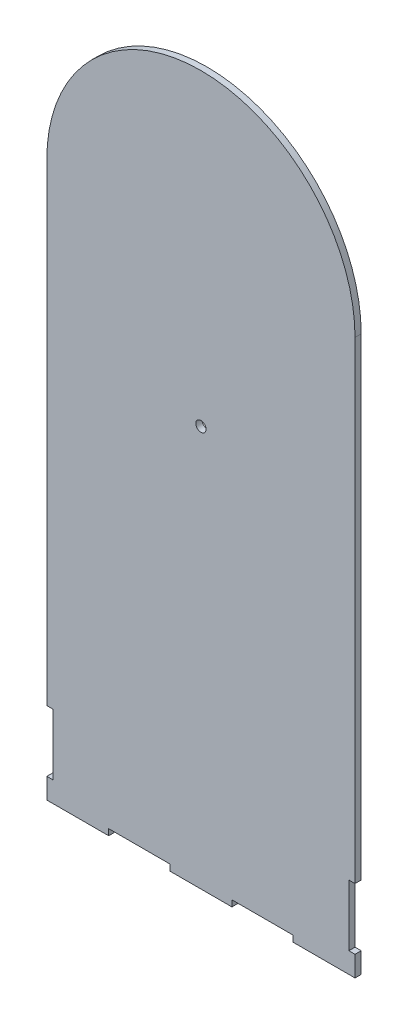
ISO-10303-21;
HEADER;
FILE_DESCRIPTION(('STEP AP214'),'2;1');
FILE_NAME('part.step','',(''),(''),'','','');
FILE_SCHEMA(('AUTOMOTIVE_DESIGN { 1 0 10303 214 1 1 1 1 }'));
ENDSEC;
DATA;
#1=APPLICATION_CONTEXT('core data for automotive mechanical design processes');
#2=APPLICATION_PROTOCOL_DEFINITION('international standard','automotive_design',2000,#1);
#3=PRODUCT_CONTEXT('',#1,'mechanical');
#4=PRODUCT('Part','Part','',(#3));
#5=PRODUCT_RELATED_PRODUCT_CATEGORY('part','',(#4));
#6=PRODUCT_DEFINITION_FORMATION('','',#4);
#7=PRODUCT_DEFINITION_CONTEXT('part definition',#1,'design');
#8=PRODUCT_DEFINITION('design','',#6,#7);
#9=PRODUCT_DEFINITION_SHAPE('','',#8);
#10=(LENGTH_UNIT() NAMED_UNIT(*) SI_UNIT(.MILLI.,.METRE.));
#11=(NAMED_UNIT(*) PLANE_ANGLE_UNIT() SI_UNIT($,.RADIAN.));
#12=(NAMED_UNIT(*) SI_UNIT($,.STERADIAN.) SOLID_ANGLE_UNIT());
#13=UNCERTAINTY_MEASURE_WITH_UNIT(LENGTH_MEASURE(1.E-05),#10,'distance_accuracy_value','');
#14=(GEOMETRIC_REPRESENTATION_CONTEXT(3) GLOBAL_UNCERTAINTY_ASSIGNED_CONTEXT((#13)) GLOBAL_UNIT_ASSIGNED_CONTEXT((#10,
#11,#12)) REPRESENTATION_CONTEXT('',''));
#15=CARTESIAN_POINT('',(0.,0.,0.));
#16=DIRECTION('',(0.,0.,1.));
#17=DIRECTION('',(1.,0.,0.));
#18=AXIS2_PLACEMENT_3D('',#15,#16,#17);
#19=CARTESIAN_POINT('',(150.,0.,3.));
#20=DIRECTION('',(-1.,0.,0.));
#21=DIRECTION('',(0.,-1.,0.));
#22=AXIS2_PLACEMENT_3D('',#19,#20,#21);
#23=PLANE('',#22);
#24=DIRECTION('',(0.,1.,0.));
#25=VECTOR('',#24,1.);
#26=CARTESIAN_POINT('',(150.,0.,0.));
#27=LINE('',#26,#25);
#28=CARTESIAN_POINT('',(150.,39.8,0.));
#29=VERTEX_POINT('',#28);
#30=CARTESIAN_POINT('',(150.,270.,0.));
#31=VERTEX_POINT('',#30);
#32=EDGE_CURVE('E221',#29,#31,#27,.T.);
#33=ORIENTED_EDGE('',*,*,#32,.T.);
#34=DIRECTION('',(0.,0.,-1.));
#35=VECTOR('',#34,1.);
#36=CARTESIAN_POINT('',(150.,270.,3.));
#37=LINE('',#36,#35);
#38=CARTESIAN_POINT('',(150.,270.,3.));
#39=VERTEX_POINT('',#38);
#40=EDGE_CURVE('E11',#39,#31,#37,.T.);
#41=ORIENTED_EDGE('',*,*,#40,.F.);
#42=DIRECTION('',(0.,1.,0.));
#43=VECTOR('',#42,1.);
#44=CARTESIAN_POINT('',(150.,0.,3.));
#45=LINE('',#44,#43);
#46=CARTESIAN_POINT('',(150.,39.8,3.));
#47=VERTEX_POINT('',#46);
#48=EDGE_CURVE('E287',#47,#39,#45,.T.);
#49=ORIENTED_EDGE('',*,*,#48,.F.);
#50=DIRECTION('',(0.,0.,-1.));
#51=VECTOR('',#50,1.);
#52=CARTESIAN_POINT('',(150.,39.8,3.));
#53=LINE('',#52,#51);
#54=EDGE_CURVE('E59',#47,#29,#53,.T.);
#55=ORIENTED_EDGE('',*,*,#54,.T.);
#56=EDGE_LOOP('',(#33,#41,#49,#55));
#57=FACE_BOUND('',#56,.T.);
#58=ADVANCED_FACE('F41',(#57),#23,.F.);
#59=CARTESIAN_POINT('',(75.,270.,3.));
#60=DIRECTION('',(0.,0.,-1.));
#61=DIRECTION('',(-1.,0.,0.));
#62=AXIS2_PLACEMENT_3D('',#59,#60,#61);
#63=CYLINDRICAL_SURFACE('',#62,75.);
#64=CARTESIAN_POINT('',(75.,270.,0.));
#65=DIRECTION('',(0.,0.,1.));
#66=DIRECTION('',(1.,0.,0.));
#67=AXIS2_PLACEMENT_3D('',#64,#65,#66);
#68=CIRCLE('',#67,75.);
#69=CARTESIAN_POINT('',(0.,270.,0.));
#70=VERTEX_POINT('',#69);
#71=EDGE_CURVE('E224',#31,#70,#68,.T.);
#72=ORIENTED_EDGE('',*,*,#71,.T.);
#73=DIRECTION('',(0.,0.,-1.));
#74=VECTOR('',#73,1.);
#75=CARTESIAN_POINT('',(0.,270.,3.));
#76=LINE('',#75,#74);
#77=CARTESIAN_POINT('',(0.,270.,3.));
#78=VERTEX_POINT('',#77);
#79=EDGE_CURVE('E51',#78,#70,#76,.T.);
#80=ORIENTED_EDGE('',*,*,#79,.F.);
#81=CARTESIAN_POINT('',(75.,270.,3.));
#82=DIRECTION('',(0.,0.,1.));
#83=DIRECTION('',(1.,0.,0.));
#84=AXIS2_PLACEMENT_3D('',#81,#82,#83);
#85=CIRCLE('',#84,75.);
#86=EDGE_CURVE('E133',#39,#78,#85,.T.);
#87=ORIENTED_EDGE('',*,*,#86,.F.);
#88=ORIENTED_EDGE('',*,*,#40,.T.);
#89=EDGE_LOOP('',(#72,#80,#87,#88));
#90=FACE_BOUND('',#89,.T.);
#91=ADVANCED_FACE('F43',(#90),#63,.T.);
#92=CARTESIAN_POINT('',(0.,0.,3.));
#93=DIRECTION('',(-1.,0.,0.));
#94=DIRECTION('',(0.,0.,1.));
#95=AXIS2_PLACEMENT_3D('',#92,#93,#94);
#96=PLANE('',#95);
#97=DIRECTION('',(0.,1.,0.));
#98=VECTOR('',#97,1.);
#99=CARTESIAN_POINT('',(0.,0.,0.));
#100=LINE('',#99,#98);
#101=CARTESIAN_POINT('',(0.,39.8,0.));
#102=VERTEX_POINT('',#101);
#103=EDGE_CURVE('E229',#102,#70,#100,.T.);
#104=ORIENTED_EDGE('',*,*,#103,.F.);
#105=DIRECTION('',(0.,0.,-1.));
#106=VECTOR('',#105,1.);
#107=CARTESIAN_POINT('',(0.,39.8,3.));
#108=LINE('',#107,#106);
#109=CARTESIAN_POINT('',(0.,39.8,3.));
#110=VERTEX_POINT('',#109);
#111=EDGE_CURVE('E339',#110,#102,#108,.T.);
#112=ORIENTED_EDGE('',*,*,#111,.F.);
#113=DIRECTION('',(0.,1.,0.));
#114=VECTOR('',#113,1.);
#115=CARTESIAN_POINT('',(0.,0.,3.));
#116=LINE('',#115,#114);
#117=EDGE_CURVE('E347',#110,#78,#116,.T.);
#118=ORIENTED_EDGE('',*,*,#117,.T.);
#119=ORIENTED_EDGE('',*,*,#79,.T.);
#120=EDGE_LOOP('',(#104,#112,#118,#119));
#121=FACE_BOUND('',#120,.T.);
#122=ADVANCED_FACE('F345',(#121),#96,.T.);
#123=CARTESIAN_POINT('',(0.,39.8,3.));
#124=DIRECTION('',(0.,1.,0.));
#125=DIRECTION('',(0.,0.,1.));
#126=AXIS2_PLACEMENT_3D('',#123,#124,#125);
#127=PLANE('',#126);
#128=DIRECTION('',(1.,0.,0.));
#129=VECTOR('',#128,1.);
#130=CARTESIAN_POINT('',(0.,39.8,0.));
#131=LINE('',#130,#129);
#132=CARTESIAN_POINT('',(2.99999999999998,39.8,0.));
#133=VERTEX_POINT('',#132);
#134=EDGE_CURVE('E233',#102,#133,#131,.T.);
#135=ORIENTED_EDGE('',*,*,#134,.T.);
#136=DIRECTION('',(0.,0.,-1.));
#137=VECTOR('',#136,1.);
#138=CARTESIAN_POINT('',(2.99999999999998,39.8,3.));
#139=LINE('',#138,#137);
#140=CARTESIAN_POINT('',(2.99999999999998,39.8,3.));
#141=VERTEX_POINT('',#140);
#142=EDGE_CURVE('E335',#141,#133,#139,.T.);
#143=ORIENTED_EDGE('',*,*,#142,.F.);
#144=DIRECTION('',(1.,0.,0.));
#145=VECTOR('',#144,1.);
#146=CARTESIAN_POINT('',(0.,39.8,3.));
#147=LINE('',#146,#145);
#148=EDGE_CURVE('E367',#110,#141,#147,.T.);
#149=ORIENTED_EDGE('',*,*,#148,.F.);
#150=ORIENTED_EDGE('',*,*,#111,.T.);
#151=EDGE_LOOP('',(#135,#143,#149,#150));
#152=FACE_BOUND('',#151,.T.);
#153=ADVANCED_FACE('F356',(#152),#127,.F.);
#154=CARTESIAN_POINT('',(3.00000000000001,0.,3.));
#155=DIRECTION('',(1.,0.,0.));
#156=DIRECTION('',(0.,1.,0.));
#157=AXIS2_PLACEMENT_3D('',#154,#155,#156);
#158=PLANE('',#157);
#159=DIRECTION('',(0.,-1.,0.));
#160=VECTOR('',#159,1.);
#161=CARTESIAN_POINT('',(3.00000000000001,0.,0.));
#162=LINE('',#161,#160);
#163=CARTESIAN_POINT('',(3.,10.,0.));
#164=VERTEX_POINT('',#163);
#165=EDGE_CURVE('E237',#133,#164,#162,.T.);
#166=ORIENTED_EDGE('',*,*,#165,.T.);
#167=DIRECTION('',(0.,0.,-1.));
#168=VECTOR('',#167,1.);
#169=CARTESIAN_POINT('',(3.,10.,3.));
#170=LINE('',#169,#168);
#171=CARTESIAN_POINT('',(3.,10.,3.));
#172=VERTEX_POINT('',#171);
#173=EDGE_CURVE('E332',#172,#164,#170,.T.);
#174=ORIENTED_EDGE('',*,*,#173,.F.);
#175=DIRECTION('',(0.,-1.,0.));
#176=VECTOR('',#175,1.);
#177=CARTESIAN_POINT('',(3.00000000000001,0.,3.));
#178=LINE('',#177,#176);
#179=EDGE_CURVE('E362',#141,#172,#178,.T.);
#180=ORIENTED_EDGE('',*,*,#179,.F.);
#181=ORIENTED_EDGE('',*,*,#142,.T.);
#182=EDGE_LOOP('',(#166,#174,#180,#181));
#183=FACE_BOUND('',#182,.T.);
#184=ADVANCED_FACE('F360',(#183),#158,.F.);
#185=CARTESIAN_POINT('',(0.,9.99999999999999,3.));
#186=DIRECTION('',(0.,1.,0.));
#187=DIRECTION('',(-1.,0.,0.));
#188=AXIS2_PLACEMENT_3D('',#185,#186,#187);
#189=PLANE('',#188);
#190=DIRECTION('',(1.,0.,0.));
#191=VECTOR('',#190,1.);
#192=CARTESIAN_POINT('',(0.,9.99999999999999,0.));
#193=LINE('',#192,#191);
#194=CARTESIAN_POINT('',(0.,10.,0.));
#195=VERTEX_POINT('',#194);
#196=EDGE_CURVE('E241',#195,#164,#193,.T.);
#197=ORIENTED_EDGE('',*,*,#196,.F.);
#198=DIRECTION('',(0.,0.,-1.));
#199=VECTOR('',#198,1.);
#200=CARTESIAN_POINT('',(0.,10.,3.));
#201=LINE('',#200,#199);
#202=CARTESIAN_POINT('',(0.,10.,3.));
#203=VERTEX_POINT('',#202);
#204=EDGE_CURVE('E329',#203,#195,#201,.T.);
#205=ORIENTED_EDGE('',*,*,#204,.F.);
#206=DIRECTION('',(1.,0.,0.));
#207=VECTOR('',#206,1.);
#208=CARTESIAN_POINT('',(0.,9.99999999999999,3.));
#209=LINE('',#208,#207);
#210=EDGE_CURVE('E366',#203,#172,#209,.T.);
#211=ORIENTED_EDGE('',*,*,#210,.T.);
#212=ORIENTED_EDGE('',*,*,#173,.T.);
#213=EDGE_LOOP('',(#197,#205,#211,#212));
#214=FACE_BOUND('',#213,.T.);
#215=ADVANCED_FACE('F420',(#214),#189,.T.);
#216=CARTESIAN_POINT('',(0.,0.,0.));
#217=VERTEX_POINT('',#216);
#218=EDGE_CURVE('E234',#217,#195,#100,.T.);
#219=ORIENTED_EDGE('',*,*,#218,.F.);
#220=DIRECTION('',(0.,0.,-1.));
#221=VECTOR('',#220,1.);
#222=CARTESIAN_POINT('',(0.,0.,3.));
#223=LINE('',#222,#221);
#224=CARTESIAN_POINT('',(0.,0.,3.));
#225=VERTEX_POINT('',#224);
#226=EDGE_CURVE('E326',#225,#217,#223,.T.);
#227=ORIENTED_EDGE('',*,*,#226,.F.);
#228=EDGE_CURVE('E371',#225,#203,#116,.T.);
#229=ORIENTED_EDGE('',*,*,#228,.T.);
#230=ORIENTED_EDGE('',*,*,#204,.T.);
#231=EDGE_LOOP('',(#219,#227,#229,#230));
#232=FACE_BOUND('',#231,.T.);
#233=ADVANCED_FACE('F415',(#232),#96,.T.);
#234=CARTESIAN_POINT('',(0.,0.,3.));
#235=DIRECTION('',(0.,1.,0.));
#236=DIRECTION('',(0.,0.,1.));
#237=AXIS2_PLACEMENT_3D('',#234,#235,#236);
#238=PLANE('',#237);
#239=DIRECTION('',(1.,0.,0.));
#240=VECTOR('',#239,1.);
#241=CARTESIAN_POINT('',(0.,0.,0.));
#242=LINE('',#241,#240);
#243=CARTESIAN_POINT('',(30.1,0.,0.));
#244=VERTEX_POINT('',#243);
#245=EDGE_CURVE('E245',#217,#244,#242,.T.);
#246=ORIENTED_EDGE('',*,*,#245,.T.);
#247=DIRECTION('',(0.,0.,-1.));
#248=VECTOR('',#247,1.);
#249=CARTESIAN_POINT('',(30.1,0.,3.));
#250=LINE('',#249,#248);
#251=CARTESIAN_POINT('',(30.1,0.,3.));
#252=VERTEX_POINT('',#251);
#253=EDGE_CURVE('E322',#252,#244,#250,.T.);
#254=ORIENTED_EDGE('',*,*,#253,.F.);
#255=DIRECTION('',(1.,0.,0.));
#256=VECTOR('',#255,1.);
#257=CARTESIAN_POINT('',(0.,0.,3.));
#258=LINE('',#257,#256);
#259=EDGE_CURVE('E376',#225,#252,#258,.T.);
#260=ORIENTED_EDGE('',*,*,#259,.F.);
#261=ORIENTED_EDGE('',*,*,#226,.T.);
#262=EDGE_LOOP('',(#246,#254,#260,#261));
#263=FACE_BOUND('',#262,.T.);
#264=ADVANCED_FACE('F476',(#263),#238,.F.);
#265=CARTESIAN_POINT('',(30.1,0.,3.));
#266=DIRECTION('',(-1.,0.,0.));
#267=DIRECTION('',(0.,0.,1.));
#268=AXIS2_PLACEMENT_3D('',#265,#266,#267);
#269=PLANE('',#268);
#270=DIRECTION('',(0.,1.,0.));
#271=VECTOR('',#270,1.);
#272=CARTESIAN_POINT('',(30.1,0.,0.));
#273=LINE('',#272,#271);
#274=CARTESIAN_POINT('',(30.1,3.,0.));
#275=VERTEX_POINT('',#274);
#276=EDGE_CURVE('E248',#244,#275,#273,.T.);
#277=ORIENTED_EDGE('',*,*,#276,.T.);
#278=DIRECTION('',(0.,0.,-1.));
#279=VECTOR('',#278,1.);
#280=CARTESIAN_POINT('',(30.1,3.,3.));
#281=LINE('',#280,#279);
#282=CARTESIAN_POINT('',(30.1,3.,3.));
#283=VERTEX_POINT('',#282);
#284=EDGE_CURVE('E318',#283,#275,#281,.T.);
#285=ORIENTED_EDGE('',*,*,#284,.F.);
#286=DIRECTION('',(0.,1.,0.));
#287=VECTOR('',#286,1.);
#288=CARTESIAN_POINT('',(30.1,0.,3.));
#289=LINE('',#288,#287);
#290=EDGE_CURVE('E379',#252,#283,#289,.T.);
#291=ORIENTED_EDGE('',*,*,#290,.F.);
#292=ORIENTED_EDGE('',*,*,#253,.T.);
#293=EDGE_LOOP('',(#277,#285,#291,#292));
#294=FACE_BOUND('',#293,.T.);
#295=ADVANCED_FACE('F483',(#294),#269,.F.);
#296=CARTESIAN_POINT('',(0.,3.,3.));
#297=DIRECTION('',(0.,1.,0.));
#298=DIRECTION('',(0.,0.,1.));
#299=AXIS2_PLACEMENT_3D('',#296,#297,#298);
#300=PLANE('',#299);
#301=DIRECTION('',(1.,0.,0.));
#302=VECTOR('',#301,1.);
#303=CARTESIAN_POINT('',(0.,3.,0.));
#304=LINE('',#303,#302);
#305=CARTESIAN_POINT('',(59.9,3.,0.));
#306=VERTEX_POINT('',#305);
#307=EDGE_CURVE('E252',#275,#306,#304,.T.);
#308=ORIENTED_EDGE('',*,*,#307,.T.);
#309=DIRECTION('',(0.,0.,-1.));
#310=VECTOR('',#309,1.);
#311=CARTESIAN_POINT('',(59.9,3.,3.));
#312=LINE('',#311,#310);
#313=CARTESIAN_POINT('',(59.9,3.,3.));
#314=VERTEX_POINT('',#313);
#315=EDGE_CURVE('E315',#314,#306,#312,.T.);
#316=ORIENTED_EDGE('',*,*,#315,.F.);
#317=DIRECTION('',(1.,0.,0.));
#318=VECTOR('',#317,1.);
#319=CARTESIAN_POINT('',(0.,3.,3.));
#320=LINE('',#319,#318);
#321=EDGE_CURVE('E383',#283,#314,#320,.T.);
#322=ORIENTED_EDGE('',*,*,#321,.F.);
#323=ORIENTED_EDGE('',*,*,#284,.T.);
#324=EDGE_LOOP('',(#308,#316,#322,#323));
#325=FACE_BOUND('',#324,.T.);
#326=ADVANCED_FACE('F479',(#325),#300,.F.);
#327=CARTESIAN_POINT('',(59.9,0.,3.));
#328=DIRECTION('',(-1.,0.,0.));
#329=DIRECTION('',(0.,0.,1.));
#330=AXIS2_PLACEMENT_3D('',#327,#328,#329);
#331=PLANE('',#330);
#332=DIRECTION('',(0.,1.,0.));
#333=VECTOR('',#332,1.);
#334=CARTESIAN_POINT('',(59.9,0.,0.));
#335=LINE('',#334,#333);
#336=CARTESIAN_POINT('',(59.9,0.,0.));
#337=VERTEX_POINT('',#336);
#338=EDGE_CURVE('E256',#337,#306,#335,.T.);
#339=ORIENTED_EDGE('',*,*,#338,.F.);
#340=DIRECTION('',(0.,0.,-1.));
#341=VECTOR('',#340,1.);
#342=CARTESIAN_POINT('',(59.9,0.,3.));
#343=LINE('',#342,#341);
#344=CARTESIAN_POINT('',(59.9,0.,3.));
#345=VERTEX_POINT('',#344);
#346=EDGE_CURVE('E312',#345,#337,#343,.T.);
#347=ORIENTED_EDGE('',*,*,#346,.F.);
#348=DIRECTION('',(0.,1.,0.));
#349=VECTOR('',#348,1.);
#350=CARTESIAN_POINT('',(59.9,0.,3.));
#351=LINE('',#350,#349);
#352=EDGE_CURVE('E386',#345,#314,#351,.T.);
#353=ORIENTED_EDGE('',*,*,#352,.T.);
#354=ORIENTED_EDGE('',*,*,#315,.T.);
#355=EDGE_LOOP('',(#339,#347,#353,#354));
#356=FACE_BOUND('',#355,.T.);
#357=ADVANCED_FACE('F474',(#356),#331,.T.);
#358=CARTESIAN_POINT('',(90.1,0.,0.));
#359=VERTEX_POINT('',#358);
#360=EDGE_CURVE('E249',#337,#359,#242,.T.);
#361=ORIENTED_EDGE('',*,*,#360,.T.);
#362=DIRECTION('',(0.,0.,-1.));
#363=VECTOR('',#362,1.);
#364=CARTESIAN_POINT('',(90.1,0.,3.));
#365=LINE('',#364,#363);
#366=CARTESIAN_POINT('',(90.1,0.,3.));
#367=VERTEX_POINT('',#366);
#368=EDGE_CURVE('E308',#367,#359,#365,.T.);
#369=ORIENTED_EDGE('',*,*,#368,.F.);
#370=EDGE_CURVE('E380',#345,#367,#258,.T.);
#371=ORIENTED_EDGE('',*,*,#370,.F.);
#372=ORIENTED_EDGE('',*,*,#346,.T.);
#373=EDGE_LOOP('',(#361,#369,#371,#372));
#374=FACE_BOUND('',#373,.T.);
#375=ADVANCED_FACE('F470',(#374),#238,.F.);
#376=CARTESIAN_POINT('',(90.1,0.,3.));
#377=DIRECTION('',(-1.,0.,0.));
#378=DIRECTION('',(0.,0.,1.));
#379=AXIS2_PLACEMENT_3D('',#376,#377,#378);
#380=PLANE('',#379);
#381=DIRECTION('',(0.,1.,0.));
#382=VECTOR('',#381,1.);
#383=CARTESIAN_POINT('',(90.1,0.,0.));
#384=LINE('',#383,#382);
#385=CARTESIAN_POINT('',(90.1,3.,0.));
#386=VERTEX_POINT('',#385);
#387=EDGE_CURVE('E260',#359,#386,#384,.T.);
#388=ORIENTED_EDGE('',*,*,#387,.T.);
#389=DIRECTION('',(0.,0.,-1.));
#390=VECTOR('',#389,1.);
#391=CARTESIAN_POINT('',(90.1,3.,3.));
#392=LINE('',#391,#390);
#393=CARTESIAN_POINT('',(90.1,3.,3.));
#394=VERTEX_POINT('',#393);
#395=EDGE_CURVE('E304',#394,#386,#392,.T.);
#396=ORIENTED_EDGE('',*,*,#395,.F.);
#397=DIRECTION('',(0.,1.,0.));
#398=VECTOR('',#397,1.);
#399=CARTESIAN_POINT('',(90.1,0.,3.));
#400=LINE('',#399,#398);
#401=EDGE_CURVE('E390',#367,#394,#400,.T.);
#402=ORIENTED_EDGE('',*,*,#401,.F.);
#403=ORIENTED_EDGE('',*,*,#368,.T.);
#404=EDGE_LOOP('',(#388,#396,#402,#403));
#405=FACE_BOUND('',#404,.T.);
#406=ADVANCED_FACE('F466',(#405),#380,.F.);
#407=CARTESIAN_POINT('',(0.,3.,3.));
#408=DIRECTION('',(0.,1.,0.));
#409=DIRECTION('',(0.,0.,1.));
#410=AXIS2_PLACEMENT_3D('',#407,#408,#409);
#411=PLANE('',#410);
#412=DIRECTION('',(1.,0.,0.));
#413=VECTOR('',#412,1.);
#414=CARTESIAN_POINT('',(0.,3.,0.));
#415=LINE('',#414,#413);
#416=CARTESIAN_POINT('',(119.9,3.,0.));
#417=VERTEX_POINT('',#416);
#418=EDGE_CURVE('E263',#386,#417,#415,.T.);
#419=ORIENTED_EDGE('',*,*,#418,.T.);
#420=DIRECTION('',(0.,0.,-1.));
#421=VECTOR('',#420,1.);
#422=CARTESIAN_POINT('',(119.9,3.,3.));
#423=LINE('',#422,#421);
#424=CARTESIAN_POINT('',(119.9,3.,3.));
#425=VERTEX_POINT('',#424);
#426=EDGE_CURVE('E301',#425,#417,#423,.T.);
#427=ORIENTED_EDGE('',*,*,#426,.F.);
#428=DIRECTION('',(1.,0.,0.));
#429=VECTOR('',#428,1.);
#430=CARTESIAN_POINT('',(0.,3.,3.));
#431=LINE('',#430,#429);
#432=EDGE_CURVE('E393',#394,#425,#431,.T.);
#433=ORIENTED_EDGE('',*,*,#432,.F.);
#434=ORIENTED_EDGE('',*,*,#395,.T.);
#435=EDGE_LOOP('',(#419,#427,#433,#434));
#436=FACE_BOUND('',#435,.T.);
#437=ADVANCED_FACE('F460',(#436),#411,.F.);
#438=CARTESIAN_POINT('',(119.9,0.,3.));
#439=DIRECTION('',(-1.,0.,0.));
#440=DIRECTION('',(0.,0.,1.));
#441=AXIS2_PLACEMENT_3D('',#438,#439,#440);
#442=PLANE('',#441);
#443=DIRECTION('',(0.,1.,0.));
#444=VECTOR('',#443,1.);
#445=CARTESIAN_POINT('',(119.9,0.,0.));
#446=LINE('',#445,#444);
#447=CARTESIAN_POINT('',(119.9,0.,0.));
#448=VERTEX_POINT('',#447);
#449=EDGE_CURVE('E267',#448,#417,#446,.T.);
#450=ORIENTED_EDGE('',*,*,#449,.F.);
#451=DIRECTION('',(0.,0.,-1.));
#452=VECTOR('',#451,1.);
#453=CARTESIAN_POINT('',(119.9,0.,3.));
#454=LINE('',#453,#452);
#455=CARTESIAN_POINT('',(119.9,0.,3.));
#456=VERTEX_POINT('',#455);
#457=EDGE_CURVE('E298',#456,#448,#454,.T.);
#458=ORIENTED_EDGE('',*,*,#457,.F.);
#459=DIRECTION('',(0.,1.,0.));
#460=VECTOR('',#459,1.);
#461=CARTESIAN_POINT('',(119.9,0.,3.));
#462=LINE('',#461,#460);
#463=EDGE_CURVE('E396',#456,#425,#462,.T.);
#464=ORIENTED_EDGE('',*,*,#463,.T.);
#465=ORIENTED_EDGE('',*,*,#426,.T.);
#466=EDGE_LOOP('',(#450,#458,#464,#465));
#467=FACE_BOUND('',#466,.T.);
#468=ADVANCED_FACE('F455',(#467),#442,.T.);
#469=CARTESIAN_POINT('',(0.,0.,3.));
#470=DIRECTION('',(0.,1.,0.));
#471=DIRECTION('',(0.,0.,1.));
#472=AXIS2_PLACEMENT_3D('',#469,#470,#471);
#473=PLANE('',#472);
#474=DIRECTION('',(1.,0.,0.));
#475=VECTOR('',#474,1.);
#476=CARTESIAN_POINT('',(0.,0.,0.));
#477=LINE('',#476,#475);
#478=CARTESIAN_POINT('',(150.,0.,0.));
#479=VERTEX_POINT('',#478);
#480=EDGE_CURVE('E271',#448,#479,#477,.T.);
#481=ORIENTED_EDGE('',*,*,#480,.T.);
#482=DIRECTION('',(0.,0.,-1.));
#483=VECTOR('',#482,1.);
#484=CARTESIAN_POINT('',(150.,0.,3.));
#485=LINE('',#484,#483);
#486=CARTESIAN_POINT('',(150.,0.,3.));
#487=VERTEX_POINT('',#486);
#488=EDGE_CURVE('E294',#487,#479,#485,.T.);
#489=ORIENTED_EDGE('',*,*,#488,.F.);
#490=DIRECTION('',(1.,0.,0.));
#491=VECTOR('',#490,1.);
#492=CARTESIAN_POINT('',(0.,0.,3.));
#493=LINE('',#492,#491);
#494=EDGE_CURVE('E399',#456,#487,#493,.T.);
#495=ORIENTED_EDGE('',*,*,#494,.F.);
#496=ORIENTED_EDGE('',*,*,#457,.T.);
#497=EDGE_LOOP('',(#481,#489,#495,#496));
#498=FACE_BOUND('',#497,.T.);
#499=ADVANCED_FACE('F450',(#498),#473,.F.);
#500=CARTESIAN_POINT('',(150.,9.99999999999999,0.));
#501=VERTEX_POINT('',#500);
#502=EDGE_CURVE('E225',#479,#501,#27,.T.);
#503=ORIENTED_EDGE('',*,*,#502,.T.);
#504=DIRECTION('',(0.,0.,-1.));
#505=VECTOR('',#504,1.);
#506=CARTESIAN_POINT('',(150.,9.99999999999999,3.));
#507=LINE('',#506,#505);
#508=CARTESIAN_POINT('',(150.,9.99999999999999,3.));
#509=VERTEX_POINT('',#508);
#510=EDGE_CURVE('E207',#509,#501,#507,.T.);
#511=ORIENTED_EDGE('',*,*,#510,.F.);
#512=EDGE_CURVE('E193',#487,#509,#45,.T.);
#513=ORIENTED_EDGE('',*,*,#512,.F.);
#514=ORIENTED_EDGE('',*,*,#488,.T.);
#515=EDGE_LOOP('',(#503,#511,#513,#514));
#516=FACE_BOUND('',#515,.T.);
#517=ADVANCED_FACE('F429',(#516),#23,.F.);
#518=CARTESIAN_POINT('',(0.,10.000000000001,3.));
#519=DIRECTION('',(0.,-1.,0.));
#520=DIRECTION('',(1.,0.,0.));
#521=AXIS2_PLACEMENT_3D('',#518,#519,#520);
#522=PLANE('',#521);
#523=DIRECTION('',(-1.,0.,0.));
#524=VECTOR('',#523,1.);
#525=CARTESIAN_POINT('',(0.,10.000000000001,0.));
#526=LINE('',#525,#524);
#527=CARTESIAN_POINT('',(147.,10.,0.));
#528=VERTEX_POINT('',#527);
#529=EDGE_CURVE('E203',#501,#528,#526,.T.);
#530=ORIENTED_EDGE('',*,*,#529,.T.);
#531=DIRECTION('',(0.,0.,-1.));
#532=VECTOR('',#531,1.);
#533=CARTESIAN_POINT('',(147.,10.,3.));
#534=LINE('',#533,#532);
#535=CARTESIAN_POINT('',(147.,10.,3.));
#536=VERTEX_POINT('',#535);
#537=EDGE_CURVE('E200',#536,#528,#534,.T.);
#538=ORIENTED_EDGE('',*,*,#537,.F.);
#539=DIRECTION('',(-1.,0.,0.));
#540=VECTOR('',#539,1.);
#541=CARTESIAN_POINT('',(0.,10.000000000001,3.));
#542=LINE('',#541,#540);
#543=EDGE_CURVE('E185',#509,#536,#542,.T.);
#544=ORIENTED_EDGE('',*,*,#543,.F.);
#545=ORIENTED_EDGE('',*,*,#510,.T.);
#546=EDGE_LOOP('',(#530,#538,#544,#545));
#547=FACE_BOUND('',#546,.T.);
#548=ADVANCED_FACE('F201',(#547),#522,.F.);
#549=CARTESIAN_POINT('',(147.,-1.36915087768371E-13,3.));
#550=DIRECTION('',(1.,0.,0.));
#551=DIRECTION('',(0.,1.,0.));
#552=AXIS2_PLACEMENT_3D('',#549,#550,#551);
#553=PLANE('',#552);
#554=DIRECTION('',(0.,-1.,0.));
#555=VECTOR('',#554,1.);
#556=CARTESIAN_POINT('',(147.,-1.36915087768371E-13,0.));
#557=LINE('',#556,#555);
#558=CARTESIAN_POINT('',(147.,39.8,0.));
#559=VERTEX_POINT('',#558);
#560=EDGE_CURVE('E276',#559,#528,#557,.T.);
#561=ORIENTED_EDGE('',*,*,#560,.F.);
#562=DIRECTION('',(0.,0.,-1.));
#563=VECTOR('',#562,1.);
#564=CARTESIAN_POINT('',(147.,39.8,3.));
#565=LINE('',#564,#563);
#566=CARTESIAN_POINT('',(147.,39.8,3.));
#567=VERTEX_POINT('',#566);
#568=EDGE_CURVE('E121',#567,#559,#565,.T.);
#569=ORIENTED_EDGE('',*,*,#568,.F.);
#570=DIRECTION('',(0.,-1.,0.));
#571=VECTOR('',#570,1.);
#572=CARTESIAN_POINT('',(147.,-1.36915087768371E-13,3.));
#573=LINE('',#572,#571);
#574=EDGE_CURVE('E191',#567,#536,#573,.T.);
#575=ORIENTED_EDGE('',*,*,#574,.T.);
#576=ORIENTED_EDGE('',*,*,#537,.T.);
#577=EDGE_LOOP('',(#561,#569,#575,#576));
#578=FACE_BOUND('',#577,.T.);
#579=ADVANCED_FACE('F209',(#578),#553,.T.);
#580=CARTESIAN_POINT('',(0.,39.8,3.));
#581=DIRECTION('',(0.,-1.,0.));
#582=DIRECTION('',(0.,0.,-1.));
#583=AXIS2_PLACEMENT_3D('',#580,#581,#582);
#584=PLANE('',#583);
#585=DIRECTION('',(-1.,0.,0.));
#586=VECTOR('',#585,1.);
#587=CARTESIAN_POINT('',(0.,39.8,0.));
#588=LINE('',#587,#586);
#589=EDGE_CURVE('E279',#29,#559,#588,.T.);
#590=ORIENTED_EDGE('',*,*,#589,.F.);
#591=ORIENTED_EDGE('',*,*,#54,.F.);
#592=DIRECTION('',(-1.,0.,0.));
#593=VECTOR('',#592,1.);
#594=CARTESIAN_POINT('',(0.,39.8,3.));
#595=LINE('',#594,#593);
#596=EDGE_CURVE('E211',#47,#567,#595,.T.);
#597=ORIENTED_EDGE('',*,*,#596,.T.);
#598=ORIENTED_EDGE('',*,*,#568,.T.);
#599=EDGE_LOOP('',(#590,#591,#597,#598));
#600=FACE_BOUND('',#599,.T.);
#601=ADVANCED_FACE('F431',(#600),#584,.T.);
#602=CARTESIAN_POINT('',(75.,195.,3.));
#603=DIRECTION('',(0.,0.,-1.));
#604=DIRECTION('',(-1.,0.,0.));
#605=AXIS2_PLACEMENT_3D('',#602,#603,#604);
#606=CYLINDRICAL_SURFACE('',#605,2.50000000000001);
#607=CARTESIAN_POINT('',(75.,195.,3.));
#608=DIRECTION('',(0.,0.,1.));
#609=DIRECTION('',(1.,0.,0.));
#610=AXIS2_PLACEMENT_3D('',#607,#608,#609);
#611=CIRCLE('',#610,2.50000000000001);
#612=CARTESIAN_POINT('',(77.5,195.,3.));
#613=VERTEX_POINT('',#612);
#614=EDGE_CURVE('E214',#613,#613,#611,.T.);
#615=ORIENTED_EDGE('',*,*,#614,.T.);
#616=EDGE_LOOP('',(#615));
#617=FACE_BOUND('',#616,.T.);
#618=CARTESIAN_POINT('',(75.,195.,0.));
#619=DIRECTION('',(0.,0.,1.));
#620=DIRECTION('',(1.,0.,0.));
#621=AXIS2_PLACEMENT_3D('',#618,#619,#620);
#622=CIRCLE('',#621,2.50000000000001);
#623=CARTESIAN_POINT('',(77.5,195.,0.));
#624=VERTEX_POINT('',#623);
#625=EDGE_CURVE('E283',#624,#624,#622,.T.);
#626=ORIENTED_EDGE('',*,*,#625,.F.);
#627=EDGE_LOOP('',(#626));
#628=FACE_BOUND('',#627,.T.);
#629=ADVANCED_FACE('F433',(#617,#628),#606,.F.);
#630=CARTESIAN_POINT('',(0.,0.,3.));
#631=DIRECTION('',(0.,0.,1.));
#632=DIRECTION('',(1.,0.,0.));
#633=AXIS2_PLACEMENT_3D('',#630,#631,#632);
#634=PLANE('',#633);
#635=ORIENTED_EDGE('',*,*,#48,.T.);
#636=ORIENTED_EDGE('',*,*,#86,.T.);
#637=ORIENTED_EDGE('',*,*,#117,.F.);
#638=ORIENTED_EDGE('',*,*,#148,.T.);
#639=ORIENTED_EDGE('',*,*,#179,.T.);
#640=ORIENTED_EDGE('',*,*,#210,.F.);
#641=ORIENTED_EDGE('',*,*,#228,.F.);
#642=ORIENTED_EDGE('',*,*,#259,.T.);
#643=ORIENTED_EDGE('',*,*,#290,.T.);
#644=ORIENTED_EDGE('',*,*,#321,.T.);
#645=ORIENTED_EDGE('',*,*,#352,.F.);
#646=ORIENTED_EDGE('',*,*,#370,.T.);
#647=ORIENTED_EDGE('',*,*,#401,.T.);
#648=ORIENTED_EDGE('',*,*,#432,.T.);
#649=ORIENTED_EDGE('',*,*,#463,.F.);
#650=ORIENTED_EDGE('',*,*,#494,.T.);
#651=ORIENTED_EDGE('',*,*,#512,.T.);
#652=ORIENTED_EDGE('',*,*,#543,.T.);
#653=ORIENTED_EDGE('',*,*,#574,.F.);
#654=ORIENTED_EDGE('',*,*,#596,.F.);
#655=EDGE_LOOP('',(#635,#636,#637,#638,#639,#640,#641,#642,#643,#644,#645,#646,#647,#648,#649,
#650,#651,#652,#653,#654));
#656=FACE_BOUND('',#655,.T.);
#657=ORIENTED_EDGE('',*,*,#614,.F.);
#658=EDGE_LOOP('',(#657));
#659=FACE_BOUND('',#658,.T.);
#660=ADVANCED_FACE('F187',(#656,#659),#634,.T.);
#661=CARTESIAN_POINT('',(0.,0.,0.));
#662=DIRECTION('',(0.,0.,1.));
#663=DIRECTION('',(1.,0.,0.));
#664=AXIS2_PLACEMENT_3D('',#661,#662,#663);
#665=PLANE('',#664);
#666=ORIENTED_EDGE('',*,*,#32,.F.);
#667=ORIENTED_EDGE('',*,*,#589,.T.);
#668=ORIENTED_EDGE('',*,*,#560,.T.);
#669=ORIENTED_EDGE('',*,*,#529,.F.);
#670=ORIENTED_EDGE('',*,*,#502,.F.);
#671=ORIENTED_EDGE('',*,*,#480,.F.);
#672=ORIENTED_EDGE('',*,*,#449,.T.);
#673=ORIENTED_EDGE('',*,*,#418,.F.);
#674=ORIENTED_EDGE('',*,*,#387,.F.);
#675=ORIENTED_EDGE('',*,*,#360,.F.);
#676=ORIENTED_EDGE('',*,*,#338,.T.);
#677=ORIENTED_EDGE('',*,*,#307,.F.);
#678=ORIENTED_EDGE('',*,*,#276,.F.);
#679=ORIENTED_EDGE('',*,*,#245,.F.);
#680=ORIENTED_EDGE('',*,*,#218,.T.);
#681=ORIENTED_EDGE('',*,*,#196,.T.);
#682=ORIENTED_EDGE('',*,*,#165,.F.);
#683=ORIENTED_EDGE('',*,*,#134,.F.);
#684=ORIENTED_EDGE('',*,*,#103,.T.);
#685=ORIENTED_EDGE('',*,*,#71,.F.);
#686=EDGE_LOOP('',(#666,#667,#668,#669,#670,#671,#672,#673,#674,#675,#676,#677,#678,#679,#680,
#681,#682,#683,#684,#685));
#687=FACE_BOUND('',#686,.T.);
#688=ORIENTED_EDGE('',*,*,#625,.T.);
#689=EDGE_LOOP('',(#688));
#690=FACE_BOUND('',#689,.T.);
#691=ADVANCED_FACE('F351',(#687,#690),#665,.F.);
#692=CLOSED_SHELL('',(#58,#91,#122,#153,#184,#215,#233,#264,#295,#326,#357,#375,#406,#437,#468,
#499,#517,#548,#579,#601,#629,#660,#691));
#693=MANIFOLD_SOLID_BREP('B2',#692);
#694=ADVANCED_BREP_SHAPE_REPRESENTATION('',(#18,#693),#14);
#695=SHAPE_DEFINITION_REPRESENTATION(#9,#694);
ENDSEC;
END-ISO-10303-21;
